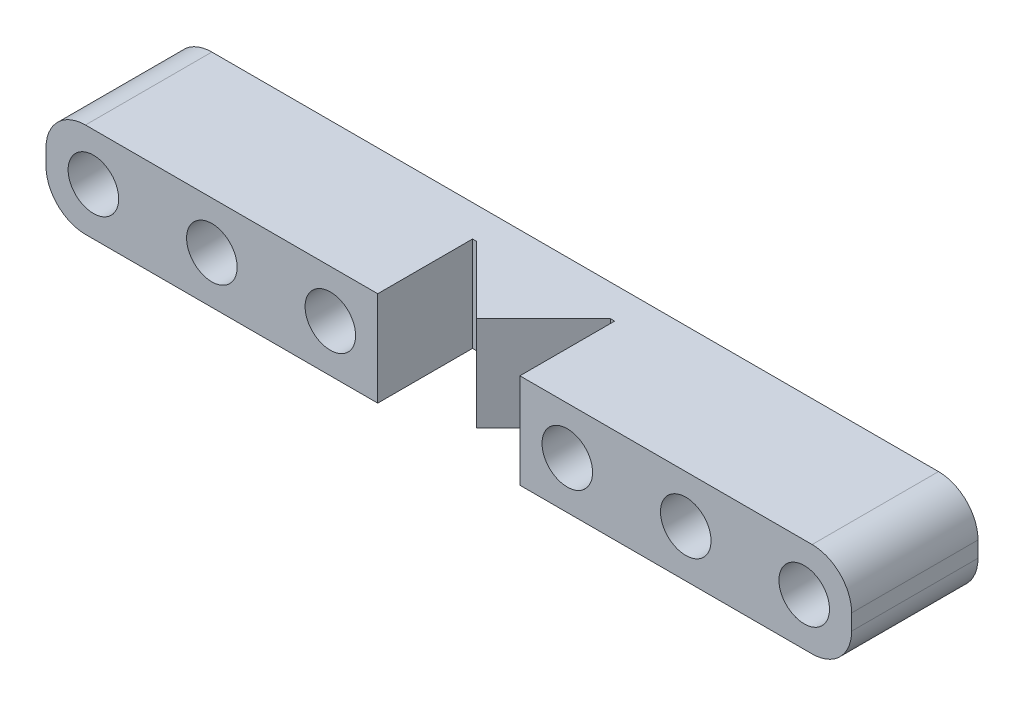
ISO-10303-21;
HEADER;
FILE_DESCRIPTION(('STEP AP214'),'2;1');
FILE_NAME('part.step','',(''),(''),'','','');
FILE_SCHEMA(('AUTOMOTIVE_DESIGN { 1 0 10303 214 1 1 1 1 }'));
ENDSEC;
DATA;
#1=APPLICATION_CONTEXT('core data for automotive mechanical design processes');
#2=APPLICATION_PROTOCOL_DEFINITION('international standard','automotive_design',2000,#1);
#3=PRODUCT_CONTEXT('',#1,'mechanical');
#4=PRODUCT('Part','Part','',(#3));
#5=PRODUCT_RELATED_PRODUCT_CATEGORY('part','',(#4));
#6=PRODUCT_DEFINITION_FORMATION('','',#4);
#7=PRODUCT_DEFINITION_CONTEXT('part definition',#1,'design');
#8=PRODUCT_DEFINITION('design','',#6,#7);
#9=PRODUCT_DEFINITION_SHAPE('','',#8);
#10=(LENGTH_UNIT() NAMED_UNIT(*) SI_UNIT(.MILLI.,.METRE.));
#11=(NAMED_UNIT(*) PLANE_ANGLE_UNIT() SI_UNIT($,.RADIAN.));
#12=(NAMED_UNIT(*) SI_UNIT($,.STERADIAN.) SOLID_ANGLE_UNIT());
#13=UNCERTAINTY_MEASURE_WITH_UNIT(LENGTH_MEASURE(1.E-05),#10,'distance_accuracy_value','');
#14=(GEOMETRIC_REPRESENTATION_CONTEXT(3) GLOBAL_UNCERTAINTY_ASSIGNED_CONTEXT((#13)) GLOBAL_UNIT_ASSIGNED_CONTEXT((#10,
#11,#12)) REPRESENTATION_CONTEXT('',''));
#15=CARTESIAN_POINT('',(0.,0.,0.));
#16=DIRECTION('',(0.,0.,1.));
#17=DIRECTION('',(1.,0.,0.));
#18=AXIS2_PLACEMENT_3D('',#15,#16,#17);
#19=CARTESIAN_POINT('',(3.,5.,2.));
#20=DIRECTION('',(0.,0.,-1.));
#21=DIRECTION('',(-1.,0.,0.));
#22=AXIS2_PLACEMENT_3D('',#19,#20,#21);
#23=PLANE('',#22);
#24=DIRECTION('',(1.,0.,0.));
#25=VECTOR('',#24,1.);
#26=CARTESIAN_POINT('',(3.,-3.,2.));
#27=LINE('',#26,#25);
#28=CARTESIAN_POINT('',(3.,-3.,2.));
#29=VERTEX_POINT('',#28);
#30=CARTESIAN_POINT('',(3.25735931288069,-3.,2.));
#31=VERTEX_POINT('',#30);
#32=EDGE_CURVE('E261',#29,#31,#27,.T.);
#33=ORIENTED_EDGE('',*,*,#32,.T.);
#34=DIRECTION('',(0.,-1.,0.));
#35=VECTOR('',#34,1.);
#36=CARTESIAN_POINT('',(3.25735931288069,12.4868329805051,2.));
#37=LINE('',#36,#35);
#38=CARTESIAN_POINT('',(3.25735931288069,3.,2.));
#39=VERTEX_POINT('',#38);
#40=EDGE_CURVE('E249',#39,#31,#37,.T.);
#41=ORIENTED_EDGE('',*,*,#40,.F.);
#42=DIRECTION('',(1.,0.,0.));
#43=VECTOR('',#42,1.);
#44=CARTESIAN_POINT('',(-0.499999999999983,3.,2.));
#45=LINE('',#44,#43);
#46=CARTESIAN_POINT('',(3.,3.,2.));
#47=VERTEX_POINT('',#46);
#48=EDGE_CURVE('E270',#47,#39,#45,.T.);
#49=ORIENTED_EDGE('',*,*,#48,.F.);
#50=DIRECTION('',(0.,-1.,0.));
#51=VECTOR('',#50,1.);
#52=CARTESIAN_POINT('',(3.,5.,2.));
#53=LINE('',#52,#51);
#54=EDGE_CURVE('E60',#47,#29,#53,.T.);
#55=ORIENTED_EDGE('',*,*,#54,.T.);
#56=EDGE_LOOP('',(#33,#41,#49,#55));
#57=FACE_BOUND('',#56,.T.);
#58=ADVANCED_FACE('F37',(#57),#23,.F.);
#59=CARTESIAN_POINT('',(15.5,-0.5,8.));
#60=DIRECTION('',(0.,0.,1.));
#61=DIRECTION('',(1.,0.,0.));
#62=AXIS2_PLACEMENT_3D('',#59,#60,#61);
#63=PLANE('',#62);
#64=DIRECTION('',(0.,-1.,0.));
#65=VECTOR('',#64,1.);
#66=CARTESIAN_POINT('',(3.,-0.5,8.));
#67=LINE('',#66,#65);
#68=CARTESIAN_POINT('',(3.,3.,8.));
#69=VERTEX_POINT('',#68);
#70=CARTESIAN_POINT('',(3.,-3.,8.));
#71=VERTEX_POINT('',#70);
#72=EDGE_CURVE('E280',#69,#71,#67,.T.);
#73=ORIENTED_EDGE('',*,*,#72,.F.);
#74=DIRECTION('',(-1.,0.,0.));
#75=VECTOR('',#74,1.);
#76=CARTESIAN_POINT('',(-0.499999999999983,3.,8.));
#77=LINE('',#76,#75);
#78=CARTESIAN_POINT('',(-15.5,3.,8.));
#79=VERTEX_POINT('',#78);
#80=EDGE_CURVE('E295',#69,#79,#77,.T.);
#81=ORIENTED_EDGE('',*,*,#80,.T.);
#82=CARTESIAN_POINT('',(-15.5,0.5,8.));
#83=DIRECTION('',(0.,0.,-1.));
#84=DIRECTION('',(-1.,0.,0.));
#85=AXIS2_PLACEMENT_3D('',#82,#83,#84);
#86=CIRCLE('',#85,2.5);
#87=CARTESIAN_POINT('',(-18.,0.5,8.));
#88=VERTEX_POINT('',#87);
#89=EDGE_CURVE('E210',#79,#88,#86,.F.);
#90=ORIENTED_EDGE('',*,*,#89,.T.);
#91=DIRECTION('',(0.,-1.,0.));
#92=VECTOR('',#91,1.);
#93=CARTESIAN_POINT('',(-18.,0.,8.));
#94=LINE('',#93,#92);
#95=CARTESIAN_POINT('',(-18.,-0.5,8.));
#96=VERTEX_POINT('',#95);
#97=EDGE_CURVE('E217',#88,#96,#94,.T.);
#98=ORIENTED_EDGE('',*,*,#97,.T.);
#99=CARTESIAN_POINT('',(-15.5,-0.5,8.));
#100=DIRECTION('',(0.,0.,-1.));
#101=DIRECTION('',(-1.,0.,0.));
#102=AXIS2_PLACEMENT_3D('',#99,#100,#101);
#103=CIRCLE('',#102,2.5);
#104=CARTESIAN_POINT('',(-15.5,-3.,8.));
#105=VERTEX_POINT('',#104);
#106=EDGE_CURVE('E214',#105,#96,#103,.T.);
#107=ORIENTED_EDGE('',*,*,#106,.F.);
#108=DIRECTION('',(1.,0.,0.));
#109=VECTOR('',#108,1.);
#110=CARTESIAN_POINT('',(-0.499999999999982,-3.,8.));
#111=LINE('',#110,#109);
#112=EDGE_CURVE('E45',#105,#71,#111,.T.);
#113=ORIENTED_EDGE('',*,*,#112,.T.);
#114=EDGE_LOOP('',(#73,#81,#90,#98,#107,#113));
#115=FACE_BOUND('',#114,.T.);
#116=CARTESIAN_POINT('',(0.,0.,8.));
#117=DIRECTION('',(0.,0.,1.));
#118=DIRECTION('',(1.,0.,0.));
#119=AXIS2_PLACEMENT_3D('',#116,#117,#118);
#120=CIRCLE('',#119,1.6);
#121=CARTESIAN_POINT('',(1.6,0.,8.));
#122=VERTEX_POINT('',#121);
#123=EDGE_CURVE('E289',#122,#122,#120,.T.);
#124=ORIENTED_EDGE('',*,*,#123,.F.);
#125=EDGE_LOOP('',(#124));
#126=FACE_BOUND('',#125,.T.);
#127=CARTESIAN_POINT('',(-15.,0.,8.));
#128=DIRECTION('',(0.,0.,-1.));
#129=DIRECTION('',(-1.,0.,0.));
#130=AXIS2_PLACEMENT_3D('',#127,#128,#129);
#131=CIRCLE('',#130,1.6);
#132=CARTESIAN_POINT('',(-16.6,0.,8.));
#133=VERTEX_POINT('',#132);
#134=EDGE_CURVE('E207',#133,#133,#131,.T.);
#135=ORIENTED_EDGE('',*,*,#134,.T.);
#136=EDGE_LOOP('',(#135));
#137=FACE_BOUND('',#136,.T.);
#138=CARTESIAN_POINT('',(-7.5,0.,8.));
#139=DIRECTION('',(0.,0.,-1.));
#140=DIRECTION('',(-1.,0.,0.));
#141=AXIS2_PLACEMENT_3D('',#138,#139,#140);
#142=CIRCLE('',#141,1.6);
#143=CARTESIAN_POINT('',(-9.1,0.,8.));
#144=VERTEX_POINT('',#143);
#145=EDGE_CURVE('E219',#144,#144,#142,.T.);
#146=ORIENTED_EDGE('',*,*,#145,.T.);
#147=EDGE_LOOP('',(#146));
#148=FACE_BOUND('',#147,.T.);
#149=ADVANCED_FACE('F302',(#115,#126,#137,#148),#63,.T.);
#150=DIRECTION('',(0.,1.,0.));
#151=VECTOR('',#150,1.);
#152=CARTESIAN_POINT('',(12.,-0.5,8.));
#153=LINE('',#152,#151);
#154=CARTESIAN_POINT('',(12.,-3.,8.));
#155=VERTEX_POINT('',#154);
#156=CARTESIAN_POINT('',(12.,3.,8.));
#157=VERTEX_POINT('',#156);
#158=EDGE_CURVE('E155',#155,#157,#153,.T.);
#159=ORIENTED_EDGE('',*,*,#158,.F.);
#160=CARTESIAN_POINT('',(30.5,-3.,8.));
#161=VERTEX_POINT('',#160);
#162=EDGE_CURVE('E146',#155,#161,#111,.T.);
#163=ORIENTED_EDGE('',*,*,#162,.T.);
#164=CARTESIAN_POINT('',(30.5,-0.5,8.));
#165=DIRECTION('',(0.,0.,-1.));
#166=DIRECTION('',(-1.,0.,0.));
#167=AXIS2_PLACEMENT_3D('',#164,#165,#166);
#168=CIRCLE('',#167,2.5);
#169=CARTESIAN_POINT('',(33.,-0.5,8.));
#170=VERTEX_POINT('',#169);
#171=EDGE_CURVE('E152',#161,#170,#168,.F.);
#172=ORIENTED_EDGE('',*,*,#171,.T.);
#173=DIRECTION('',(0.,-1.,0.));
#174=VECTOR('',#173,1.);
#175=CARTESIAN_POINT('',(33.,0.,8.));
#176=LINE('',#175,#174);
#177=CARTESIAN_POINT('',(33.,0.5,8.));
#178=VERTEX_POINT('',#177);
#179=EDGE_CURVE('E179',#178,#170,#176,.T.);
#180=ORIENTED_EDGE('',*,*,#179,.F.);
#181=CARTESIAN_POINT('',(30.5,0.5,8.));
#182=DIRECTION('',(0.,0.,-1.));
#183=DIRECTION('',(-1.,0.,0.));
#184=AXIS2_PLACEMENT_3D('',#181,#182,#183);
#185=CIRCLE('',#184,2.5);
#186=CARTESIAN_POINT('',(30.5,3.,8.));
#187=VERTEX_POINT('',#186);
#188=EDGE_CURVE('E175',#187,#178,#185,.T.);
#189=ORIENTED_EDGE('',*,*,#188,.F.);
#190=EDGE_CURVE('E158',#187,#157,#77,.T.);
#191=ORIENTED_EDGE('',*,*,#190,.T.);
#192=EDGE_LOOP('',(#159,#163,#172,#180,#189,#191));
#193=FACE_BOUND('',#192,.T.);
#194=CARTESIAN_POINT('',(15.,0.,8.));
#195=DIRECTION('',(0.,0.,1.));
#196=DIRECTION('',(1.,0.,0.));
#197=AXIS2_PLACEMENT_3D('',#194,#195,#196);
#198=CIRCLE('',#197,1.6);
#199=CARTESIAN_POINT('',(16.6,0.,8.));
#200=VERTEX_POINT('',#199);
#201=EDGE_CURVE('E283',#200,#200,#198,.T.);
#202=ORIENTED_EDGE('',*,*,#201,.F.);
#203=EDGE_LOOP('',(#202));
#204=FACE_BOUND('',#203,.T.);
#205=CARTESIAN_POINT('',(30.,0.,8.));
#206=DIRECTION('',(0.,0.,-1.));
#207=DIRECTION('',(-1.,0.,0.));
#208=AXIS2_PLACEMENT_3D('',#205,#206,#207);
#209=CIRCLE('',#208,1.6);
#210=CARTESIAN_POINT('',(28.4,0.,8.));
#211=VERTEX_POINT('',#210);
#212=EDGE_CURVE('E176',#211,#211,#209,.F.);
#213=ORIENTED_EDGE('',*,*,#212,.F.);
#214=EDGE_LOOP('',(#213));
#215=FACE_BOUND('',#214,.T.);
#216=CARTESIAN_POINT('',(22.5,0.,8.));
#217=DIRECTION('',(0.,0.,-1.));
#218=DIRECTION('',(-1.,0.,0.));
#219=AXIS2_PLACEMENT_3D('',#216,#217,#218);
#220=CIRCLE('',#219,1.6);
#221=CARTESIAN_POINT('',(20.9,0.,8.));
#222=VERTEX_POINT('',#221);
#223=EDGE_CURVE('E170',#222,#222,#220,.F.);
#224=ORIENTED_EDGE('',*,*,#223,.F.);
#225=EDGE_LOOP('',(#224));
#226=FACE_BOUND('',#225,.T.);
#227=ADVANCED_FACE('F148',(#193,#204,#215,#226),#63,.T.);
#228=CARTESIAN_POINT('',(15.5,-0.5,0.));
#229=DIRECTION('',(0.,0.,1.));
#230=DIRECTION('',(1.,0.,0.));
#231=AXIS2_PLACEMENT_3D('',#228,#229,#230);
#232=PLANE('',#231);
#233=CARTESIAN_POINT('',(30.5,-0.5,0.));
#234=DIRECTION('',(0.,0.,-1.));
#235=DIRECTION('',(-1.,0.,0.));
#236=AXIS2_PLACEMENT_3D('',#233,#234,#235);
#237=CIRCLE('',#236,2.5);
#238=CARTESIAN_POINT('',(30.5,-3.,0.));
#239=VERTEX_POINT('',#238);
#240=CARTESIAN_POINT('',(33.,-0.5,0.));
#241=VERTEX_POINT('',#240);
#242=EDGE_CURVE('E191',#239,#241,#237,.F.);
#243=ORIENTED_EDGE('',*,*,#242,.F.);
#244=DIRECTION('',(1.,0.,0.));
#245=VECTOR('',#244,1.);
#246=CARTESIAN_POINT('',(-0.499999999999982,-3.,0.));
#247=LINE('',#246,#245);
#248=CARTESIAN_POINT('',(-15.5,-3.,0.));
#249=VERTEX_POINT('',#248);
#250=EDGE_CURVE('E165',#249,#239,#247,.T.);
#251=ORIENTED_EDGE('',*,*,#250,.F.);
#252=CARTESIAN_POINT('',(-15.5,-0.5,0.));
#253=DIRECTION('',(0.,0.,-1.));
#254=DIRECTION('',(-1.,0.,0.));
#255=AXIS2_PLACEMENT_3D('',#252,#253,#254);
#256=CIRCLE('',#255,2.5);
#257=CARTESIAN_POINT('',(-18.,-0.5,0.));
#258=VERTEX_POINT('',#257);
#259=EDGE_CURVE('E228',#249,#258,#256,.T.);
#260=ORIENTED_EDGE('',*,*,#259,.T.);
#261=DIRECTION('',(0.,-1.,0.));
#262=VECTOR('',#261,1.);
#263=CARTESIAN_POINT('',(-18.,0.,0.));
#264=LINE('',#263,#262);
#265=CARTESIAN_POINT('',(-18.,0.5,0.));
#266=VERTEX_POINT('',#265);
#267=EDGE_CURVE('E231',#266,#258,#264,.T.);
#268=ORIENTED_EDGE('',*,*,#267,.F.);
#269=CARTESIAN_POINT('',(-15.5,0.5,0.));
#270=DIRECTION('',(0.,0.,-1.));
#271=DIRECTION('',(-1.,0.,0.));
#272=AXIS2_PLACEMENT_3D('',#269,#270,#271);
#273=CIRCLE('',#272,2.5);
#274=CARTESIAN_POINT('',(-15.5,3.,0.));
#275=VERTEX_POINT('',#274);
#276=EDGE_CURVE('E225',#275,#266,#273,.F.);
#277=ORIENTED_EDGE('',*,*,#276,.F.);
#278=DIRECTION('',(-1.,0.,0.));
#279=VECTOR('',#278,1.);
#280=CARTESIAN_POINT('',(-0.499999999999983,3.,0.));
#281=LINE('',#280,#279);
#282=CARTESIAN_POINT('',(30.5,3.,0.));
#283=VERTEX_POINT('',#282);
#284=EDGE_CURVE('E292',#283,#275,#281,.T.);
#285=ORIENTED_EDGE('',*,*,#284,.F.);
#286=CARTESIAN_POINT('',(30.5,0.5,0.));
#287=DIRECTION('',(0.,0.,-1.));
#288=DIRECTION('',(-1.,0.,0.));
#289=AXIS2_PLACEMENT_3D('',#286,#287,#288);
#290=CIRCLE('',#289,2.5);
#291=CARTESIAN_POINT('',(33.,0.5,0.));
#292=VERTEX_POINT('',#291);
#293=EDGE_CURVE('E193',#283,#292,#290,.T.);
#294=ORIENTED_EDGE('',*,*,#293,.T.);
#295=DIRECTION('',(0.,-1.,0.));
#296=VECTOR('',#295,1.);
#297=CARTESIAN_POINT('',(33.,0.,0.));
#298=LINE('',#297,#296);
#299=EDGE_CURVE('E196',#292,#241,#298,.T.);
#300=ORIENTED_EDGE('',*,*,#299,.T.);
#301=EDGE_LOOP('',(#243,#251,#260,#268,#277,#285,#294,#300));
#302=FACE_BOUND('',#301,.T.);
#303=CARTESIAN_POINT('',(0.,0.,0.));
#304=DIRECTION('',(0.,0.,1.));
#305=DIRECTION('',(1.,0.,0.));
#306=AXIS2_PLACEMENT_3D('',#303,#304,#305);
#307=CIRCLE('',#306,1.6);
#308=CARTESIAN_POINT('',(1.6,0.,0.));
#309=VERTEX_POINT('',#308);
#310=EDGE_CURVE('E286',#309,#309,#307,.T.);
#311=ORIENTED_EDGE('',*,*,#310,.T.);
#312=EDGE_LOOP('',(#311));
#313=FACE_BOUND('',#312,.T.);
#314=CARTESIAN_POINT('',(15.,0.,0.));
#315=DIRECTION('',(0.,0.,1.));
#316=DIRECTION('',(1.,0.,0.));
#317=AXIS2_PLACEMENT_3D('',#314,#315,#316);
#318=CIRCLE('',#317,1.6);
#319=CARTESIAN_POINT('',(16.6,0.,0.));
#320=VERTEX_POINT('',#319);
#321=EDGE_CURVE('E282',#320,#320,#318,.T.);
#322=ORIENTED_EDGE('',*,*,#321,.T.);
#323=EDGE_LOOP('',(#322));
#324=FACE_BOUND('',#323,.T.);
#325=CARTESIAN_POINT('',(-15.,0.,0.));
#326=DIRECTION('',(0.,0.,-1.));
#327=DIRECTION('',(-1.,0.,0.));
#328=AXIS2_PLACEMENT_3D('',#325,#326,#327);
#329=CIRCLE('',#328,1.6);
#330=CARTESIAN_POINT('',(-16.6,0.,0.));
#331=VERTEX_POINT('',#330);
#332=EDGE_CURVE('E202',#331,#331,#329,.T.);
#333=ORIENTED_EDGE('',*,*,#332,.F.);
#334=EDGE_LOOP('',(#333));
#335=FACE_BOUND('',#334,.T.);
#336=CARTESIAN_POINT('',(-7.5,0.,0.));
#337=DIRECTION('',(0.,0.,-1.));
#338=DIRECTION('',(-1.,0.,0.));
#339=AXIS2_PLACEMENT_3D('',#336,#337,#338);
#340=CIRCLE('',#339,1.6);
#341=CARTESIAN_POINT('',(-9.1,0.,0.));
#342=VERTEX_POINT('',#341);
#343=EDGE_CURVE('E211',#342,#342,#340,.T.);
#344=ORIENTED_EDGE('',*,*,#343,.F.);
#345=EDGE_LOOP('',(#344));
#346=FACE_BOUND('',#345,.T.);
#347=CARTESIAN_POINT('',(30.,0.,0.));
#348=DIRECTION('',(0.,0.,-1.));
#349=DIRECTION('',(-1.,0.,0.));
#350=AXIS2_PLACEMENT_3D('',#347,#348,#349);
#351=CIRCLE('',#350,1.6);
#352=CARTESIAN_POINT('',(28.4,0.,0.));
#353=VERTEX_POINT('',#352);
#354=EDGE_CURVE('E188',#353,#353,#351,.F.);
#355=ORIENTED_EDGE('',*,*,#354,.T.);
#356=EDGE_LOOP('',(#355));
#357=FACE_BOUND('',#356,.T.);
#358=CARTESIAN_POINT('',(22.5,0.,0.));
#359=DIRECTION('',(0.,0.,-1.));
#360=DIRECTION('',(-1.,0.,0.));
#361=AXIS2_PLACEMENT_3D('',#358,#359,#360);
#362=CIRCLE('',#361,1.6);
#363=CARTESIAN_POINT('',(20.9,0.,0.));
#364=VERTEX_POINT('',#363);
#365=EDGE_CURVE('E182',#364,#364,#362,.F.);
#366=ORIENTED_EDGE('',*,*,#365,.T.);
#367=EDGE_LOOP('',(#366));
#368=FACE_BOUND('',#367,.T.);
#369=ADVANCED_FACE('F365',(#302,#313,#324,#335,#346,#357,#368),#232,.F.);
#370=CARTESIAN_POINT('',(-0.499999999999983,3.,8.));
#371=DIRECTION('',(0.,-1.,0.));
#372=DIRECTION('',(0.,0.,-1.));
#373=AXIS2_PLACEMENT_3D('',#370,#371,#372);
#374=PLANE('',#373);
#375=ORIENTED_EDGE('',*,*,#80,.F.);
#376=DIRECTION('',(0.,0.,-1.));
#377=VECTOR('',#376,1.);
#378=CARTESIAN_POINT('',(3.,3.,8.));
#379=LINE('',#378,#377);
#380=EDGE_CURVE('E277',#69,#47,#379,.T.);
#381=ORIENTED_EDGE('',*,*,#380,.T.);
#382=ORIENTED_EDGE('',*,*,#48,.T.);
#383=DIRECTION('',(0.707106781186551,0.,0.707106781186544));
#384=VECTOR('',#383,1.);
#385=CARTESIAN_POINT('',(3.25735931288069,3.,2.));
#386=LINE('',#385,#384);
#387=CARTESIAN_POINT('',(7.5,3.,6.24264068711926));
#388=VERTEX_POINT('',#387);
#389=EDGE_CURVE('E246',#39,#388,#386,.T.);
#390=ORIENTED_EDGE('',*,*,#389,.T.);
#391=DIRECTION('',(0.707106781186542,0.,-0.707106781186554));
#392=VECTOR('',#391,1.);
#393=CARTESIAN_POINT('',(7.5,3.,6.24264068711926));
#394=LINE('',#393,#392);
#395=CARTESIAN_POINT('',(11.7426406871192,3.,2.));
#396=VERTEX_POINT('',#395);
#397=EDGE_CURVE('E248',#388,#396,#394,.T.);
#398=ORIENTED_EDGE('',*,*,#397,.T.);
#399=CARTESIAN_POINT('',(12.,3.,2.));
#400=VERTEX_POINT('',#399);
#401=EDGE_CURVE('E268',#396,#400,#45,.T.);
#402=ORIENTED_EDGE('',*,*,#401,.T.);
#403=DIRECTION('',(0.,0.,1.));
#404=VECTOR('',#403,1.);
#405=CARTESIAN_POINT('',(12.,3.,8.));
#406=LINE('',#405,#404);
#407=EDGE_CURVE('E273',#400,#157,#406,.T.);
#408=ORIENTED_EDGE('',*,*,#407,.T.);
#409=ORIENTED_EDGE('',*,*,#190,.F.);
#410=DIRECTION('',(0.,0.,-1.));
#411=VECTOR('',#410,1.);
#412=CARTESIAN_POINT('',(30.5,3.,8.));
#413=LINE('',#412,#411);
#414=EDGE_CURVE('E169',#187,#283,#413,.T.);
#415=ORIENTED_EDGE('',*,*,#414,.T.);
#416=ORIENTED_EDGE('',*,*,#284,.T.);
#417=DIRECTION('',(0.,0.,-1.));
#418=VECTOR('',#417,1.);
#419=CARTESIAN_POINT('',(-15.5,3.,8.));
#420=LINE('',#419,#418);
#421=EDGE_CURVE('E222',#79,#275,#420,.T.);
#422=ORIENTED_EDGE('',*,*,#421,.F.);
#423=EDGE_LOOP('',(#375,#381,#382,#390,#398,#402,#408,#409,#415,#416,#422));
#424=FACE_BOUND('',#423,.T.);
#425=ADVANCED_FACE('F39',(#424),#374,.F.);
#426=CARTESIAN_POINT('',(-0.499999999999982,-3.,8.));
#427=DIRECTION('',(0.,1.,0.));
#428=DIRECTION('',(0.,0.,1.));
#429=AXIS2_PLACEMENT_3D('',#426,#427,#428);
#430=PLANE('',#429);
#431=ORIENTED_EDGE('',*,*,#32,.F.);
#432=DIRECTION('',(0.,0.,1.));
#433=VECTOR('',#432,1.);
#434=CARTESIAN_POINT('',(3.,-3.,8.));
#435=LINE('',#434,#433);
#436=EDGE_CURVE('E12',#29,#71,#435,.T.);
#437=ORIENTED_EDGE('',*,*,#436,.T.);
#438=ORIENTED_EDGE('',*,*,#112,.F.);
#439=DIRECTION('',(0.,0.,-1.));
#440=VECTOR('',#439,1.);
#441=CARTESIAN_POINT('',(-15.5,-3.,8.));
#442=LINE('',#441,#440);
#443=EDGE_CURVE('E242',#105,#249,#442,.T.);
#444=ORIENTED_EDGE('',*,*,#443,.T.);
#445=ORIENTED_EDGE('',*,*,#250,.T.);
#446=DIRECTION('',(0.,0.,-1.));
#447=VECTOR('',#446,1.);
#448=CARTESIAN_POINT('',(30.5,-3.,8.));
#449=LINE('',#448,#447);
#450=EDGE_CURVE('E161',#161,#239,#449,.T.);
#451=ORIENTED_EDGE('',*,*,#450,.F.);
#452=ORIENTED_EDGE('',*,*,#162,.F.);
#453=DIRECTION('',(0.,0.,1.));
#454=VECTOR('',#453,1.);
#455=CARTESIAN_POINT('',(12.,-3.,10.1997119874976));
#456=LINE('',#455,#454);
#457=CARTESIAN_POINT('',(12.,-3.,2.));
#458=VERTEX_POINT('',#457);
#459=EDGE_CURVE('E263',#458,#155,#456,.T.);
#460=ORIENTED_EDGE('',*,*,#459,.F.);
#461=CARTESIAN_POINT('',(11.7426406871192,-3.,2.));
#462=VERTEX_POINT('',#461);
#463=EDGE_CURVE('E260',#462,#458,#27,.T.);
#464=ORIENTED_EDGE('',*,*,#463,.F.);
#465=DIRECTION('',(-0.707106781186542,0.,0.707106781186554));
#466=VECTOR('',#465,1.);
#467=CARTESIAN_POINT('',(7.5,-3.,6.24264068711926));
#468=LINE('',#467,#466);
#469=CARTESIAN_POINT('',(7.5,-3.,6.24264068711926));
#470=VERTEX_POINT('',#469);
#471=EDGE_CURVE('E239',#462,#470,#468,.T.);
#472=ORIENTED_EDGE('',*,*,#471,.T.);
#473=DIRECTION('',(-0.707106781186551,0.,-0.707106781186544));
#474=VECTOR('',#473,1.);
#475=CARTESIAN_POINT('',(3.25735931288069,-3.,2.));
#476=LINE('',#475,#474);
#477=EDGE_CURVE('E252',#470,#31,#476,.T.);
#478=ORIENTED_EDGE('',*,*,#477,.T.);
#479=EDGE_LOOP('',(#431,#437,#438,#444,#445,#451,#452,#460,#464,#472,#478));
#480=FACE_BOUND('',#479,.T.);
#481=ADVANCED_FACE('F163',(#480),#430,.F.);
#482=CARTESIAN_POINT('',(0.,0.,8.));
#483=DIRECTION('',(0.,0.,-1.));
#484=DIRECTION('',(-1.,0.,0.));
#485=AXIS2_PLACEMENT_3D('',#482,#483,#484);
#486=CYLINDRICAL_SURFACE('',#485,1.6);
#487=ORIENTED_EDGE('',*,*,#123,.T.);
#488=EDGE_LOOP('',(#487));
#489=FACE_BOUND('',#488,.T.);
#490=ORIENTED_EDGE('',*,*,#310,.F.);
#491=EDGE_LOOP('',(#490));
#492=FACE_BOUND('',#491,.T.);
#493=ADVANCED_FACE('F354',(#489,#492),#486,.F.);
#494=CARTESIAN_POINT('',(15.,0.,8.));
#495=DIRECTION('',(0.,0.,-1.));
#496=DIRECTION('',(-1.,0.,0.));
#497=AXIS2_PLACEMENT_3D('',#494,#495,#496);
#498=CYLINDRICAL_SURFACE('',#497,1.6);
#499=ORIENTED_EDGE('',*,*,#201,.T.);
#500=EDGE_LOOP('',(#499));
#501=FACE_BOUND('',#500,.T.);
#502=ORIENTED_EDGE('',*,*,#321,.F.);
#503=EDGE_LOOP('',(#502));
#504=FACE_BOUND('',#503,.T.);
#505=ADVANCED_FACE('F350',(#501,#504),#498,.F.);
#506=ORIENTED_EDGE('',*,*,#401,.F.);
#507=DIRECTION('',(0.,-1.,0.));
#508=VECTOR('',#507,1.);
#509=CARTESIAN_POINT('',(11.7426406871192,12.4868329805051,2.));
#510=LINE('',#509,#508);
#511=EDGE_CURVE('E52',#396,#462,#510,.T.);
#512=ORIENTED_EDGE('',*,*,#511,.T.);
#513=ORIENTED_EDGE('',*,*,#463,.T.);
#514=DIRECTION('',(0.,-1.,0.));
#515=VECTOR('',#514,1.);
#516=CARTESIAN_POINT('',(12.,5.,2.));
#517=LINE('',#516,#515);
#518=EDGE_CURVE('E265',#400,#458,#517,.T.);
#519=ORIENTED_EDGE('',*,*,#518,.F.);
#520=EDGE_LOOP('',(#506,#512,#513,#519));
#521=FACE_BOUND('',#520,.T.);
#522=ADVANCED_FACE('F329',(#521),#23,.F.);
#523=CARTESIAN_POINT('',(3.,5.,10.1997119874976));
#524=DIRECTION('',(-1.,0.,0.));
#525=DIRECTION('',(0.,0.,1.));
#526=AXIS2_PLACEMENT_3D('',#523,#524,#525);
#527=PLANE('',#526);
#528=ORIENTED_EDGE('',*,*,#72,.T.);
#529=ORIENTED_EDGE('',*,*,#436,.F.);
#530=ORIENTED_EDGE('',*,*,#54,.F.);
#531=ORIENTED_EDGE('',*,*,#380,.F.);
#532=EDGE_LOOP('',(#528,#529,#530,#531));
#533=FACE_BOUND('',#532,.T.);
#534=ADVANCED_FACE('F319',(#533),#527,.F.);
#535=CARTESIAN_POINT('',(12.,5.,10.1997119874976));
#536=DIRECTION('',(1.,0.,0.));
#537=DIRECTION('',(0.,0.,-1.));
#538=AXIS2_PLACEMENT_3D('',#535,#536,#537);
#539=PLANE('',#538);
#540=ORIENTED_EDGE('',*,*,#158,.T.);
#541=ORIENTED_EDGE('',*,*,#407,.F.);
#542=ORIENTED_EDGE('',*,*,#518,.T.);
#543=ORIENTED_EDGE('',*,*,#459,.T.);
#544=EDGE_LOOP('',(#540,#541,#542,#543));
#545=FACE_BOUND('',#544,.T.);
#546=ADVANCED_FACE('F333',(#545),#539,.F.);
#547=CARTESIAN_POINT('',(3.25735931288069,12.4868329805051,2.));
#548=DIRECTION('',(-0.707106781186544,0.,0.707106781186551));
#549=DIRECTION('',(0.707106781186551,0.,0.707106781186544));
#550=AXIS2_PLACEMENT_3D('',#547,#548,#549);
#551=PLANE('',#550);
#552=ORIENTED_EDGE('',*,*,#389,.F.);
#553=ORIENTED_EDGE('',*,*,#40,.T.);
#554=ORIENTED_EDGE('',*,*,#477,.F.);
#555=DIRECTION('',(0.,-1.,0.));
#556=VECTOR('',#555,1.);
#557=CARTESIAN_POINT('',(7.5,12.4868329805051,6.24264068711926));
#558=LINE('',#557,#556);
#559=EDGE_CURVE('E256',#388,#470,#558,.T.);
#560=ORIENTED_EDGE('',*,*,#559,.F.);
#561=EDGE_LOOP('',(#552,#553,#554,#560));
#562=FACE_BOUND('',#561,.T.);
#563=ADVANCED_FACE('F324',(#562),#551,.T.);
#564=CARTESIAN_POINT('',(7.5,12.4868329805051,6.24264068711926));
#565=DIRECTION('',(0.707106781186554,0.,0.707106781186542));
#566=DIRECTION('',(0.707106781186542,0.,-0.707106781186554));
#567=AXIS2_PLACEMENT_3D('',#564,#565,#566);
#568=PLANE('',#567);
#569=ORIENTED_EDGE('',*,*,#397,.F.);
#570=ORIENTED_EDGE('',*,*,#559,.T.);
#571=ORIENTED_EDGE('',*,*,#471,.F.);
#572=ORIENTED_EDGE('',*,*,#511,.F.);
#573=EDGE_LOOP('',(#569,#570,#571,#572));
#574=FACE_BOUND('',#573,.T.);
#575=ADVANCED_FACE('F326',(#574),#568,.T.);
#576=CARTESIAN_POINT('',(-15.5,0.5,8.));
#577=DIRECTION('',(0.,0.,-1.));
#578=DIRECTION('',(-1.,0.,0.));
#579=AXIS2_PLACEMENT_3D('',#576,#577,#578);
#580=CYLINDRICAL_SURFACE('',#579,2.5);
#581=ORIENTED_EDGE('',*,*,#276,.T.);
#582=DIRECTION('',(0.,0.,-1.));
#583=VECTOR('',#582,1.);
#584=CARTESIAN_POINT('',(-18.,0.5,8.));
#585=LINE('',#584,#583);
#586=EDGE_CURVE('E236',#88,#266,#585,.T.);
#587=ORIENTED_EDGE('',*,*,#586,.F.);
#588=ORIENTED_EDGE('',*,*,#89,.F.);
#589=ORIENTED_EDGE('',*,*,#421,.T.);
#590=EDGE_LOOP('',(#581,#587,#588,#589));
#591=FACE_BOUND('',#590,.T.);
#592=ADVANCED_FACE('F309',(#591),#580,.T.);
#593=CARTESIAN_POINT('',(-18.,0.,8.));
#594=DIRECTION('',(1.,0.,0.));
#595=DIRECTION('',(0.,0.,-1.));
#596=AXIS2_PLACEMENT_3D('',#593,#594,#595);
#597=PLANE('',#596);
#598=ORIENTED_EDGE('',*,*,#267,.T.);
#599=DIRECTION('',(0.,0.,-1.));
#600=VECTOR('',#599,1.);
#601=CARTESIAN_POINT('',(-18.,-0.5,8.));
#602=LINE('',#601,#600);
#603=EDGE_CURVE('E240',#96,#258,#602,.T.);
#604=ORIENTED_EDGE('',*,*,#603,.F.);
#605=ORIENTED_EDGE('',*,*,#97,.F.);
#606=ORIENTED_EDGE('',*,*,#586,.T.);
#607=EDGE_LOOP('',(#598,#604,#605,#606));
#608=FACE_BOUND('',#607,.T.);
#609=ADVANCED_FACE('F311',(#608),#597,.F.);
#610=CARTESIAN_POINT('',(-15.5,-0.5,8.));
#611=DIRECTION('',(0.,0.,-1.));
#612=DIRECTION('',(-1.,0.,0.));
#613=AXIS2_PLACEMENT_3D('',#610,#611,#612);
#614=CYLINDRICAL_SURFACE('',#613,2.5);
#615=ORIENTED_EDGE('',*,*,#259,.F.);
#616=ORIENTED_EDGE('',*,*,#443,.F.);
#617=ORIENTED_EDGE('',*,*,#106,.T.);
#618=ORIENTED_EDGE('',*,*,#603,.T.);
#619=EDGE_LOOP('',(#615,#616,#617,#618));
#620=FACE_BOUND('',#619,.T.);
#621=ADVANCED_FACE('F317',(#620),#614,.T.);
#622=CARTESIAN_POINT('',(-15.,0.,8.));
#623=DIRECTION('',(0.,0.,-1.));
#624=DIRECTION('',(-1.,0.,0.));
#625=AXIS2_PLACEMENT_3D('',#622,#623,#624);
#626=CYLINDRICAL_SURFACE('',#625,1.6);
#627=ORIENTED_EDGE('',*,*,#134,.F.);
#628=EDGE_LOOP('',(#627));
#629=FACE_BOUND('',#628,.T.);
#630=ORIENTED_EDGE('',*,*,#332,.T.);
#631=EDGE_LOOP('',(#630));
#632=FACE_BOUND('',#631,.T.);
#633=ADVANCED_FACE('F489',(#629,#632),#626,.F.);
#634=CARTESIAN_POINT('',(-7.5,0.,8.));
#635=DIRECTION('',(0.,0.,-1.));
#636=DIRECTION('',(-1.,0.,0.));
#637=AXIS2_PLACEMENT_3D('',#634,#635,#636);
#638=CYLINDRICAL_SURFACE('',#637,1.6);
#639=ORIENTED_EDGE('',*,*,#145,.F.);
#640=EDGE_LOOP('',(#639));
#641=FACE_BOUND('',#640,.T.);
#642=ORIENTED_EDGE('',*,*,#343,.T.);
#643=EDGE_LOOP('',(#642));
#644=FACE_BOUND('',#643,.T.);
#645=ADVANCED_FACE('F497',(#641,#644),#638,.F.);
#646=CARTESIAN_POINT('',(30.5,-0.5,8.));
#647=DIRECTION('',(0.,0.,-1.));
#648=DIRECTION('',(-1.,0.,0.));
#649=AXIS2_PLACEMENT_3D('',#646,#647,#648);
#650=CYLINDRICAL_SURFACE('',#649,2.5);
#651=ORIENTED_EDGE('',*,*,#242,.T.);
#652=DIRECTION('',(0.,0.,-1.));
#653=VECTOR('',#652,1.);
#654=CARTESIAN_POINT('',(33.,-0.5,8.));
#655=LINE('',#654,#653);
#656=EDGE_CURVE('E173',#170,#241,#655,.T.);
#657=ORIENTED_EDGE('',*,*,#656,.F.);
#658=ORIENTED_EDGE('',*,*,#171,.F.);
#659=ORIENTED_EDGE('',*,*,#450,.T.);
#660=EDGE_LOOP('',(#651,#657,#658,#659));
#661=FACE_BOUND('',#660,.T.);
#662=ADVANCED_FACE('F172',(#661),#650,.T.);
#663=CARTESIAN_POINT('',(33.,0.,8.));
#664=DIRECTION('',(1.,0.,0.));
#665=DIRECTION('',(0.,0.,-1.));
#666=AXIS2_PLACEMENT_3D('',#663,#664,#665);
#667=PLANE('',#666);
#668=ORIENTED_EDGE('',*,*,#299,.F.);
#669=DIRECTION('',(0.,0.,-1.));
#670=VECTOR('',#669,1.);
#671=CARTESIAN_POINT('',(33.,0.5,8.));
#672=LINE('',#671,#670);
#673=EDGE_CURVE('E203',#178,#292,#672,.T.);
#674=ORIENTED_EDGE('',*,*,#673,.F.);
#675=ORIENTED_EDGE('',*,*,#179,.T.);
#676=ORIENTED_EDGE('',*,*,#656,.T.);
#677=EDGE_LOOP('',(#668,#674,#675,#676));
#678=FACE_BOUND('',#677,.T.);
#679=ADVANCED_FACE('F514',(#678),#667,.T.);
#680=CARTESIAN_POINT('',(30.5,0.5,8.));
#681=DIRECTION('',(0.,0.,-1.));
#682=DIRECTION('',(-1.,0.,0.));
#683=AXIS2_PLACEMENT_3D('',#680,#681,#682);
#684=CYLINDRICAL_SURFACE('',#683,2.5);
#685=ORIENTED_EDGE('',*,*,#293,.F.);
#686=ORIENTED_EDGE('',*,*,#414,.F.);
#687=ORIENTED_EDGE('',*,*,#188,.T.);
#688=ORIENTED_EDGE('',*,*,#673,.T.);
#689=EDGE_LOOP('',(#685,#686,#687,#688));
#690=FACE_BOUND('',#689,.T.);
#691=ADVANCED_FACE('F522',(#690),#684,.T.);
#692=CARTESIAN_POINT('',(30.,0.,8.));
#693=DIRECTION('',(0.,0.,-1.));
#694=DIRECTION('',(-1.,0.,0.));
#695=AXIS2_PLACEMENT_3D('',#692,#693,#694);
#696=CYLINDRICAL_SURFACE('',#695,1.6);
#697=ORIENTED_EDGE('',*,*,#212,.T.);
#698=EDGE_LOOP('',(#697));
#699=FACE_BOUND('',#698,.T.);
#700=ORIENTED_EDGE('',*,*,#354,.F.);
#701=EDGE_LOOP('',(#700));
#702=FACE_BOUND('',#701,.T.);
#703=ADVANCED_FACE('F531',(#699,#702),#696,.F.);
#704=CARTESIAN_POINT('',(22.5,0.,8.));
#705=DIRECTION('',(0.,0.,-1.));
#706=DIRECTION('',(-1.,0.,0.));
#707=AXIS2_PLACEMENT_3D('',#704,#705,#706);
#708=CYLINDRICAL_SURFACE('',#707,1.6);
#709=ORIENTED_EDGE('',*,*,#223,.T.);
#710=EDGE_LOOP('',(#709));
#711=FACE_BOUND('',#710,.T.);
#712=ORIENTED_EDGE('',*,*,#365,.F.);
#713=EDGE_LOOP('',(#712));
#714=FACE_BOUND('',#713,.T.);
#715=ADVANCED_FACE('F540',(#711,#714),#708,.F.);
#716=CLOSED_SHELL('',(#58,#149,#227,#369,#425,#481,#493,#505,#522,#534,#546,#563,#575,#592,#609,
#621,#633,#645,#662,#679,#691,#703,#715));
#717=MANIFOLD_SOLID_BREP('B2',#716);
#718=ADVANCED_BREP_SHAPE_REPRESENTATION('',(#18,#717),#14);
#719=SHAPE_DEFINITION_REPRESENTATION(#9,#718);
ENDSEC;
END-ISO-10303-21;
